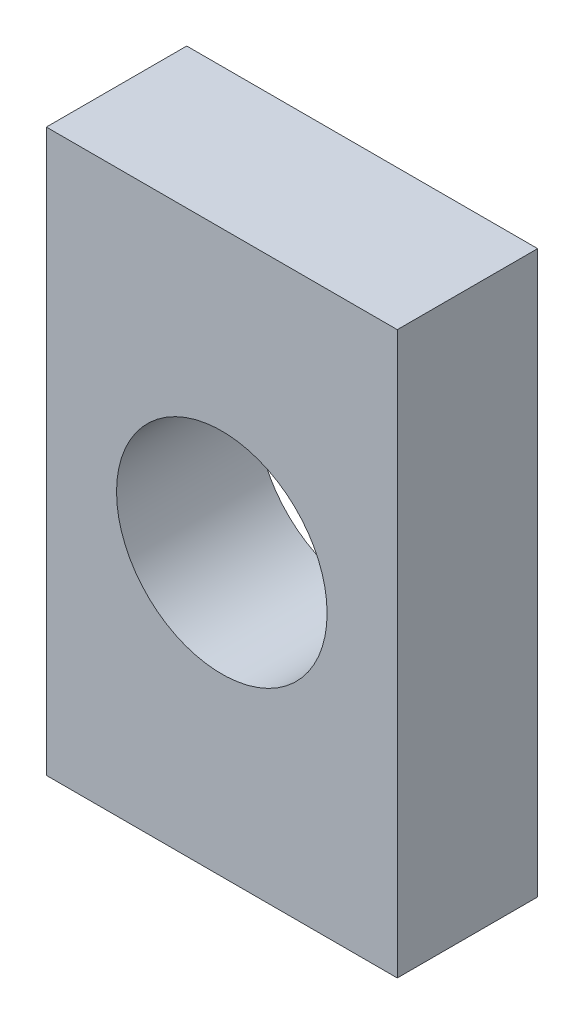
ISO-10303-21;
HEADER;
FILE_DESCRIPTION(('STEP AP214'),'2;1');
FILE_NAME('part.step','',(''),(''),'','','');
FILE_SCHEMA(('AUTOMOTIVE_DESIGN { 1 0 10303 214 1 1 1 1 }'));
ENDSEC;
DATA;
#1=APPLICATION_CONTEXT('core data for automotive mechanical design processes');
#2=APPLICATION_PROTOCOL_DEFINITION('international standard','automotive_design',2000,#1);
#3=PRODUCT_CONTEXT('',#1,'mechanical');
#4=PRODUCT('Part','Part','',(#3));
#5=PRODUCT_RELATED_PRODUCT_CATEGORY('part','',(#4));
#6=PRODUCT_DEFINITION_FORMATION('','',#4);
#7=PRODUCT_DEFINITION_CONTEXT('part definition',#1,'design');
#8=PRODUCT_DEFINITION('design','',#6,#7);
#9=PRODUCT_DEFINITION_SHAPE('','',#8);
#10=(LENGTH_UNIT() NAMED_UNIT(*) SI_UNIT(.MILLI.,.METRE.));
#11=(NAMED_UNIT(*) PLANE_ANGLE_UNIT() SI_UNIT($,.RADIAN.));
#12=(NAMED_UNIT(*) SI_UNIT($,.STERADIAN.) SOLID_ANGLE_UNIT());
#13=UNCERTAINTY_MEASURE_WITH_UNIT(LENGTH_MEASURE(1.E-05),#10,'distance_accuracy_value','');
#14=(GEOMETRIC_REPRESENTATION_CONTEXT(3) GLOBAL_UNCERTAINTY_ASSIGNED_CONTEXT((#13)) GLOBAL_UNIT_ASSIGNED_CONTEXT((#10,
#11,#12)) REPRESENTATION_CONTEXT('',''));
#15=CARTESIAN_POINT('',(0.,0.,0.));
#16=DIRECTION('',(0.,0.,1.));
#17=DIRECTION('',(1.,0.,0.));
#18=AXIS2_PLACEMENT_3D('',#15,#16,#17);
#19=CARTESIAN_POINT('',(0.,0.,2.));
#20=DIRECTION('',(0.,0.,1.));
#21=DIRECTION('',(1.,0.,0.));
#22=AXIS2_PLACEMENT_3D('',#19,#20,#21);
#23=PLANE('',#22);
#24=DIRECTION('',(0.,1.,0.));
#25=VECTOR('',#24,1.);
#26=CARTESIAN_POINT('',(2.5,4.,2.));
#27=LINE('',#26,#25);
#28=CARTESIAN_POINT('',(2.5,-4.,2.));
#29=VERTEX_POINT('',#28);
#30=CARTESIAN_POINT('',(2.5,4.,2.));
#31=VERTEX_POINT('',#30);
#32=EDGE_CURVE('E84',#29,#31,#27,.T.);
#33=ORIENTED_EDGE('',*,*,#32,.T.);
#34=DIRECTION('',(-1.,0.,0.));
#35=VECTOR('',#34,1.);
#36=CARTESIAN_POINT('',(-2.5,4.,2.));
#37=LINE('',#36,#35);
#38=CARTESIAN_POINT('',(-2.5,4.,2.));
#39=VERTEX_POINT('',#38);
#40=EDGE_CURVE('E79',#31,#39,#37,.T.);
#41=ORIENTED_EDGE('',*,*,#40,.T.);
#42=DIRECTION('',(0.,-1.,0.));
#43=VECTOR('',#42,1.);
#44=CARTESIAN_POINT('',(-2.5,4.,2.));
#45=LINE('',#44,#43);
#46=CARTESIAN_POINT('',(-2.5,-4.,2.));
#47=VERTEX_POINT('',#46);
#48=EDGE_CURVE('E82',#39,#47,#45,.T.);
#49=ORIENTED_EDGE('',*,*,#48,.T.);
#50=DIRECTION('',(1.,0.,0.));
#51=VECTOR('',#50,1.);
#52=CARTESIAN_POINT('',(-2.5,-4.,2.));
#53=LINE('',#52,#51);
#54=EDGE_CURVE('E49',#47,#29,#53,.T.);
#55=ORIENTED_EDGE('',*,*,#54,.T.);
#56=EDGE_LOOP('',(#33,#41,#49,#55));
#57=FACE_BOUND('',#56,.T.);
#58=CARTESIAN_POINT('',(0.,0.,2.));
#59=DIRECTION('',(0.,0.,1.));
#60=DIRECTION('',(1.,0.,0.));
#61=AXIS2_PLACEMENT_3D('',#58,#59,#60);
#62=CIRCLE('',#61,1.5);
#63=CARTESIAN_POINT('',(1.5,0.,2.));
#64=VERTEX_POINT('',#63);
#65=EDGE_CURVE('E99',#64,#64,#62,.T.);
#66=ORIENTED_EDGE('',*,*,#65,.F.);
#67=EDGE_LOOP('',(#66));
#68=FACE_BOUND('',#67,.T.);
#69=ADVANCED_FACE('F32',(#57,#68),#23,.T.);
#70=CARTESIAN_POINT('',(0.,0.,0.));
#71=DIRECTION('',(0.,0.,1.));
#72=DIRECTION('',(1.,0.,0.));
#73=AXIS2_PLACEMENT_3D('',#70,#71,#72);
#74=PLANE('',#73);
#75=DIRECTION('',(0.,1.,0.));
#76=VECTOR('',#75,1.);
#77=CARTESIAN_POINT('',(2.5,4.,0.));
#78=LINE('',#77,#76);
#79=CARTESIAN_POINT('',(2.5,-4.,0.));
#80=VERTEX_POINT('',#79);
#81=CARTESIAN_POINT('',(2.5,4.,0.));
#82=VERTEX_POINT('',#81);
#83=EDGE_CURVE('E96',#80,#82,#78,.T.);
#84=ORIENTED_EDGE('',*,*,#83,.F.);
#85=DIRECTION('',(1.,0.,0.));
#86=VECTOR('',#85,1.);
#87=CARTESIAN_POINT('',(-2.5,-4.,0.));
#88=LINE('',#87,#86);
#89=CARTESIAN_POINT('',(-2.5,-4.,0.));
#90=VERTEX_POINT('',#89);
#91=EDGE_CURVE('E72',#90,#80,#88,.T.);
#92=ORIENTED_EDGE('',*,*,#91,.F.);
#93=DIRECTION('',(0.,-1.,0.));
#94=VECTOR('',#93,1.);
#95=CARTESIAN_POINT('',(-2.5,4.,0.));
#96=LINE('',#95,#94);
#97=CARTESIAN_POINT('',(-2.5,4.,0.));
#98=VERTEX_POINT('',#97);
#99=EDGE_CURVE('E66',#98,#90,#96,.T.);
#100=ORIENTED_EDGE('',*,*,#99,.F.);
#101=DIRECTION('',(-1.,0.,0.));
#102=VECTOR('',#101,1.);
#103=CARTESIAN_POINT('',(-2.5,4.,0.));
#104=LINE('',#103,#102);
#105=EDGE_CURVE('E88',#82,#98,#104,.T.);
#106=ORIENTED_EDGE('',*,*,#105,.F.);
#107=EDGE_LOOP('',(#84,#92,#100,#106));
#108=FACE_BOUND('',#107,.T.);
#109=CARTESIAN_POINT('',(0.,0.,0.));
#110=DIRECTION('',(0.,0.,1.));
#111=DIRECTION('',(1.,0.,0.));
#112=AXIS2_PLACEMENT_3D('',#109,#110,#111);
#113=CIRCLE('',#112,1.5);
#114=CARTESIAN_POINT('',(1.5,0.,0.));
#115=VERTEX_POINT('',#114);
#116=EDGE_CURVE('E111',#115,#115,#113,.T.);
#117=ORIENTED_EDGE('',*,*,#116,.T.);
#118=EDGE_LOOP('',(#117));
#119=FACE_BOUND('',#118,.T.);
#120=ADVANCED_FACE('F107',(#108,#119),#74,.F.);
#121=CARTESIAN_POINT('',(2.5,4.,2.));
#122=DIRECTION('',(-1.,0.,0.));
#123=DIRECTION('',(0.,-1.,0.));
#124=AXIS2_PLACEMENT_3D('',#121,#122,#123);
#125=PLANE('',#124);
#126=ORIENTED_EDGE('',*,*,#83,.T.);
#127=DIRECTION('',(0.,0.,-1.));
#128=VECTOR('',#127,1.);
#129=CARTESIAN_POINT('',(2.5,4.,2.));
#130=LINE('',#129,#128);
#131=EDGE_CURVE('E11',#31,#82,#130,.T.);
#132=ORIENTED_EDGE('',*,*,#131,.F.);
#133=ORIENTED_EDGE('',*,*,#32,.F.);
#134=DIRECTION('',(0.,0.,-1.));
#135=VECTOR('',#134,1.);
#136=CARTESIAN_POINT('',(2.5,-4.,2.));
#137=LINE('',#136,#135);
#138=EDGE_CURVE('E92',#29,#80,#137,.T.);
#139=ORIENTED_EDGE('',*,*,#138,.T.);
#140=EDGE_LOOP('',(#126,#132,#133,#139));
#141=FACE_BOUND('',#140,.T.);
#142=ADVANCED_FACE('F34',(#141),#125,.F.);
#143=CARTESIAN_POINT('',(-2.5,4.,2.));
#144=DIRECTION('',(0.,-1.,0.));
#145=DIRECTION('',(0.,0.,-1.));
#146=AXIS2_PLACEMENT_3D('',#143,#144,#145);
#147=PLANE('',#146);
#148=ORIENTED_EDGE('',*,*,#105,.T.);
#149=DIRECTION('',(0.,0.,-1.));
#150=VECTOR('',#149,1.);
#151=CARTESIAN_POINT('',(-2.5,4.,2.));
#152=LINE('',#151,#150);
#153=EDGE_CURVE('E41',#39,#98,#152,.T.);
#154=ORIENTED_EDGE('',*,*,#153,.F.);
#155=ORIENTED_EDGE('',*,*,#40,.F.);
#156=ORIENTED_EDGE('',*,*,#131,.T.);
#157=EDGE_LOOP('',(#148,#154,#155,#156));
#158=FACE_BOUND('',#157,.T.);
#159=ADVANCED_FACE('F87',(#158),#147,.F.);
#160=CARTESIAN_POINT('',(-2.5,4.,2.));
#161=DIRECTION('',(1.,0.,0.));
#162=DIRECTION('',(0.,1.,0.));
#163=AXIS2_PLACEMENT_3D('',#160,#161,#162);
#164=PLANE('',#163);
#165=ORIENTED_EDGE('',*,*,#99,.T.);
#166=DIRECTION('',(0.,0.,-1.));
#167=VECTOR('',#166,1.);
#168=CARTESIAN_POINT('',(-2.5,-4.,2.));
#169=LINE('',#168,#167);
#170=EDGE_CURVE('E89',#47,#90,#169,.T.);
#171=ORIENTED_EDGE('',*,*,#170,.F.);
#172=ORIENTED_EDGE('',*,*,#48,.F.);
#173=ORIENTED_EDGE('',*,*,#153,.T.);
#174=EDGE_LOOP('',(#165,#171,#172,#173));
#175=FACE_BOUND('',#174,.T.);
#176=ADVANCED_FACE('F90',(#175),#164,.F.);
#177=CARTESIAN_POINT('',(-2.5,-4.,2.));
#178=DIRECTION('',(0.,1.,0.));
#179=DIRECTION('',(0.,0.,1.));
#180=AXIS2_PLACEMENT_3D('',#177,#178,#179);
#181=PLANE('',#180);
#182=ORIENTED_EDGE('',*,*,#91,.T.);
#183=ORIENTED_EDGE('',*,*,#138,.F.);
#184=ORIENTED_EDGE('',*,*,#54,.F.);
#185=ORIENTED_EDGE('',*,*,#170,.T.);
#186=EDGE_LOOP('',(#182,#183,#184,#185));
#187=FACE_BOUND('',#186,.T.);
#188=ADVANCED_FACE('F104',(#187),#181,.F.);
#189=CARTESIAN_POINT('',(0.,0.,2.));
#190=DIRECTION('',(0.,0.,-1.));
#191=DIRECTION('',(-1.,0.,0.));
#192=AXIS2_PLACEMENT_3D('',#189,#190,#191);
#193=CYLINDRICAL_SURFACE('',#192,1.5);
#194=ORIENTED_EDGE('',*,*,#65,.T.);
#195=EDGE_LOOP('',(#194));
#196=FACE_BOUND('',#195,.T.);
#197=ORIENTED_EDGE('',*,*,#116,.F.);
#198=EDGE_LOOP('',(#197));
#199=FACE_BOUND('',#198,.T.);
#200=ADVANCED_FACE('F117',(#196,#199),#193,.F.);
#201=CLOSED_SHELL('',(#69,#120,#142,#159,#176,#188,#200));
#202=MANIFOLD_SOLID_BREP('B2',#201);
#203=ADVANCED_BREP_SHAPE_REPRESENTATION('',(#18,#202),#14);
#204=SHAPE_DEFINITION_REPRESENTATION(#9,#203);
ENDSEC;
END-ISO-10303-21;
